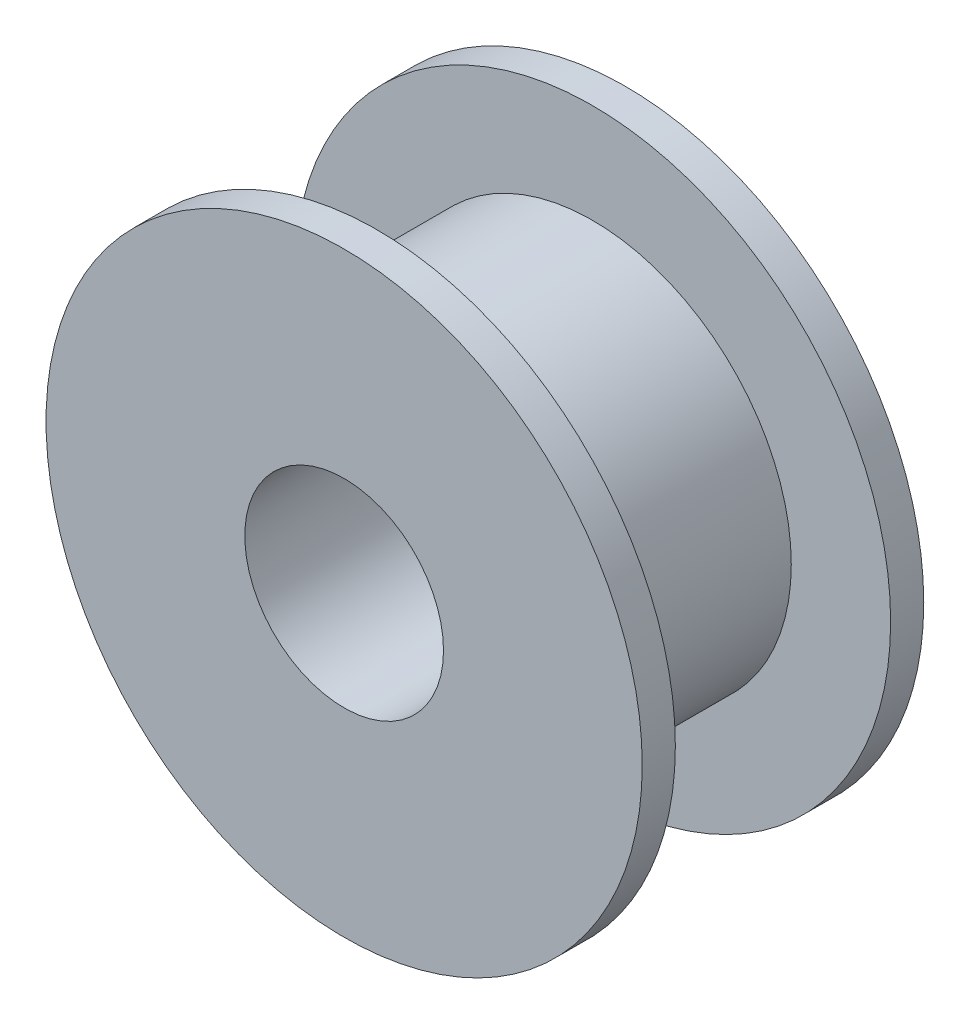
ISO-10303-21;
HEADER;
FILE_DESCRIPTION(('STEP AP214'),'2;1');
FILE_NAME('part.step','',(''),(''),'','','');
FILE_SCHEMA(('AUTOMOTIVE_DESIGN { 1 0 10303 214 1 1 1 1 }'));
ENDSEC;
DATA;
#1=APPLICATION_CONTEXT('core data for automotive mechanical design processes');
#2=APPLICATION_PROTOCOL_DEFINITION('international standard','automotive_design',2000,#1);
#3=PRODUCT_CONTEXT('',#1,'mechanical');
#4=PRODUCT('Part','Part','',(#3));
#5=PRODUCT_RELATED_PRODUCT_CATEGORY('part','',(#4));
#6=PRODUCT_DEFINITION_FORMATION('','',#4);
#7=PRODUCT_DEFINITION_CONTEXT('part definition',#1,'design');
#8=PRODUCT_DEFINITION('design','',#6,#7);
#9=PRODUCT_DEFINITION_SHAPE('','',#8);
#10=(LENGTH_UNIT() NAMED_UNIT(*) SI_UNIT(.MILLI.,.METRE.));
#11=(NAMED_UNIT(*) PLANE_ANGLE_UNIT() SI_UNIT($,.RADIAN.));
#12=(NAMED_UNIT(*) SI_UNIT($,.STERADIAN.) SOLID_ANGLE_UNIT());
#13=UNCERTAINTY_MEASURE_WITH_UNIT(LENGTH_MEASURE(1.E-05),#10,'distance_accuracy_value','');
#14=(GEOMETRIC_REPRESENTATION_CONTEXT(3) GLOBAL_UNCERTAINTY_ASSIGNED_CONTEXT((#13)) GLOBAL_UNIT_ASSIGNED_CONTEXT((#10,
#11,#12)) REPRESENTATION_CONTEXT('',''));
#15=CARTESIAN_POINT('',(0.,0.,0.));
#16=DIRECTION('',(0.,0.,1.));
#17=DIRECTION('',(1.,0.,0.));
#18=AXIS2_PLACEMENT_3D('',#15,#16,#17);
#19=CARTESIAN_POINT('',(0.,0.,4.25));
#20=DIRECTION('',(0.,0.,-1.));
#21=DIRECTION('',(-1.,0.,0.));
#22=AXIS2_PLACEMENT_3D('',#19,#20,#21);
#23=CYLINDRICAL_SURFACE('',#22,9.);
#24=CARTESIAN_POINT('',(0.,0.,-4.25));
#25=DIRECTION('',(0.,0.,1.));
#26=DIRECTION('',(1.,0.,0.));
#27=AXIS2_PLACEMENT_3D('',#24,#25,#26);
#28=CIRCLE('',#27,9.);
#29=CARTESIAN_POINT('',(9.,0.,-4.25));
#30=VERTEX_POINT('',#29);
#31=EDGE_CURVE('E18',#30,#30,#28,.T.);
#32=ORIENTED_EDGE('',*,*,#31,.T.);
#33=EDGE_LOOP('',(#32));
#34=FACE_BOUND('',#33,.T.);
#35=CARTESIAN_POINT('',(0.,0.,-3.25));
#36=DIRECTION('',(0.,0.,1.));
#37=DIRECTION('',(1.,0.,0.));
#38=AXIS2_PLACEMENT_3D('',#35,#36,#37);
#39=CIRCLE('',#38,9.);
#40=CARTESIAN_POINT('',(9.,0.,-3.25));
#41=VERTEX_POINT('',#40);
#42=EDGE_CURVE('E30',#41,#41,#39,.T.);
#43=ORIENTED_EDGE('',*,*,#42,.F.);
#44=EDGE_LOOP('',(#43));
#45=FACE_BOUND('',#44,.T.);
#46=ADVANCED_FACE('F14',(#34,#45),#23,.T.);
#47=CARTESIAN_POINT('',(0.,0.,4.25));
#48=DIRECTION('',(0.,0.,1.));
#49=DIRECTION('',(1.,0.,0.));
#50=AXIS2_PLACEMENT_3D('',#47,#48,#49);
#51=PLANE('',#50);
#52=CARTESIAN_POINT('',(0.,0.,4.25));
#53=DIRECTION('',(0.,0.,1.));
#54=DIRECTION('',(1.,0.,0.));
#55=AXIS2_PLACEMENT_3D('',#52,#53,#54);
#56=CIRCLE('',#55,9.);
#57=CARTESIAN_POINT('',(9.,0.,4.25));
#58=VERTEX_POINT('',#57);
#59=EDGE_CURVE('E9',#58,#58,#56,.T.);
#60=ORIENTED_EDGE('',*,*,#59,.T.);
#61=EDGE_LOOP('',(#60));
#62=FACE_BOUND('',#61,.T.);
#63=CARTESIAN_POINT('',(0.,0.,4.25));
#64=DIRECTION('',(0.,0.,1.));
#65=DIRECTION('',(1.,0.,0.));
#66=AXIS2_PLACEMENT_3D('',#63,#64,#65);
#67=CIRCLE('',#66,3.);
#68=CARTESIAN_POINT('',(3.,0.,4.25));
#69=VERTEX_POINT('',#68);
#70=EDGE_CURVE('E25',#69,#69,#67,.T.);
#71=ORIENTED_EDGE('',*,*,#70,.F.);
#72=EDGE_LOOP('',(#71));
#73=FACE_BOUND('',#72,.T.);
#74=ADVANCED_FACE('F57',(#62,#73),#51,.T.);
#75=CARTESIAN_POINT('',(0.,0.,-4.25));
#76=DIRECTION('',(0.,0.,1.));
#77=DIRECTION('',(1.,0.,0.));
#78=AXIS2_PLACEMENT_3D('',#75,#76,#77);
#79=PLANE('',#78);
#80=ORIENTED_EDGE('',*,*,#31,.F.);
#81=EDGE_LOOP('',(#80));
#82=FACE_BOUND('',#81,.T.);
#83=CARTESIAN_POINT('',(0.,0.,-4.25));
#84=DIRECTION('',(0.,0.,1.));
#85=DIRECTION('',(1.,0.,0.));
#86=AXIS2_PLACEMENT_3D('',#83,#84,#85);
#87=CIRCLE('',#86,3.);
#88=CARTESIAN_POINT('',(3.,0.,-4.25));
#89=VERTEX_POINT('',#88);
#90=EDGE_CURVE('E27',#89,#89,#87,.T.);
#91=ORIENTED_EDGE('',*,*,#90,.T.);
#92=EDGE_LOOP('',(#91));
#93=FACE_BOUND('',#92,.T.);
#94=ADVANCED_FACE('F63',(#82,#93),#79,.F.);
#95=CARTESIAN_POINT('',(0.,0.,3.25));
#96=DIRECTION('',(0.,0.,1.));
#97=DIRECTION('',(1.,0.,0.));
#98=AXIS2_PLACEMENT_3D('',#95,#96,#97);
#99=CIRCLE('',#98,9.);
#100=CARTESIAN_POINT('',(9.,0.,3.25));
#101=VERTEX_POINT('',#100);
#102=EDGE_CURVE('E33',#101,#101,#99,.T.);
#103=ORIENTED_EDGE('',*,*,#102,.T.);
#104=EDGE_LOOP('',(#103));
#105=FACE_BOUND('',#104,.T.);
#106=ORIENTED_EDGE('',*,*,#59,.F.);
#107=EDGE_LOOP('',(#106));
#108=FACE_BOUND('',#107,.T.);
#109=ADVANCED_FACE('F16',(#105,#108),#23,.T.);
#110=CARTESIAN_POINT('',(0.,0.,4.25));
#111=DIRECTION('',(0.,0.,-1.));
#112=DIRECTION('',(-1.,0.,0.));
#113=AXIS2_PLACEMENT_3D('',#110,#111,#112);
#114=CYLINDRICAL_SURFACE('',#113,3.);
#115=ORIENTED_EDGE('',*,*,#70,.T.);
#116=EDGE_LOOP('',(#115));
#117=FACE_BOUND('',#116,.T.);
#118=ORIENTED_EDGE('',*,*,#90,.F.);
#119=EDGE_LOOP('',(#118));
#120=FACE_BOUND('',#119,.T.);
#121=ADVANCED_FACE('F52',(#117,#120),#114,.F.);
#122=CARTESIAN_POINT('',(0.,0.,-3.25));
#123=DIRECTION('',(0.,0.,1.));
#124=DIRECTION('',(1.,0.,0.));
#125=AXIS2_PLACEMENT_3D('',#122,#123,#124);
#126=PLANE('',#125);
#127=CARTESIAN_POINT('',(0.,0.,-3.25));
#128=DIRECTION('',(0.,0.,1.));
#129=DIRECTION('',(1.,0.,0.));
#130=AXIS2_PLACEMENT_3D('',#127,#128,#129);
#131=CIRCLE('',#130,6.);
#132=CARTESIAN_POINT('',(6.,0.,-3.25));
#133=VERTEX_POINT('',#132);
#134=EDGE_CURVE('E36',#133,#133,#131,.T.);
#135=ORIENTED_EDGE('',*,*,#134,.F.);
#136=EDGE_LOOP('',(#135));
#137=FACE_BOUND('',#136,.T.);
#138=ORIENTED_EDGE('',*,*,#42,.T.);
#139=EDGE_LOOP('',(#138));
#140=FACE_BOUND('',#139,.T.);
#141=ADVANCED_FACE('F48',(#137,#140),#126,.T.);
#142=CARTESIAN_POINT('',(0.,0.,3.25));
#143=DIRECTION('',(0.,0.,1.));
#144=DIRECTION('',(1.,0.,0.));
#145=AXIS2_PLACEMENT_3D('',#142,#143,#144);
#146=PLANE('',#145);
#147=CARTESIAN_POINT('',(0.,0.,3.25));
#148=DIRECTION('',(0.,0.,1.));
#149=DIRECTION('',(1.,0.,0.));
#150=AXIS2_PLACEMENT_3D('',#147,#148,#149);
#151=CIRCLE('',#150,6.);
#152=CARTESIAN_POINT('',(6.,0.,3.25));
#153=VERTEX_POINT('',#152);
#154=EDGE_CURVE('E39',#153,#153,#151,.T.);
#155=ORIENTED_EDGE('',*,*,#154,.T.);
#156=EDGE_LOOP('',(#155));
#157=FACE_BOUND('',#156,.T.);
#158=ORIENTED_EDGE('',*,*,#102,.F.);
#159=EDGE_LOOP('',(#158));
#160=FACE_BOUND('',#159,.T.);
#161=ADVANCED_FACE('F51',(#157,#160),#146,.F.);
#162=CARTESIAN_POINT('',(0.,0.,-3.25));
#163=DIRECTION('',(0.,0.,1.));
#164=DIRECTION('',(1.,0.,0.));
#165=AXIS2_PLACEMENT_3D('',#162,#163,#164);
#166=CYLINDRICAL_SURFACE('',#165,6.);
#167=ORIENTED_EDGE('',*,*,#134,.T.);
#168=EDGE_LOOP('',(#167));
#169=FACE_BOUND('',#168,.T.);
#170=ORIENTED_EDGE('',*,*,#154,.F.);
#171=EDGE_LOOP('',(#170));
#172=FACE_BOUND('',#171,.T.);
#173=ADVANCED_FACE('F45',(#169,#172),#166,.T.);
#174=CLOSED_SHELL('',(#46,#74,#94,#109,#121,#141,#161,#173));
#175=MANIFOLD_SOLID_BREP('B1',#174);
#176=ADVANCED_BREP_SHAPE_REPRESENTATION('',(#18,#175),#14);
#177=SHAPE_DEFINITION_REPRESENTATION(#9,#176);
ENDSEC;
END-ISO-10303-21;
